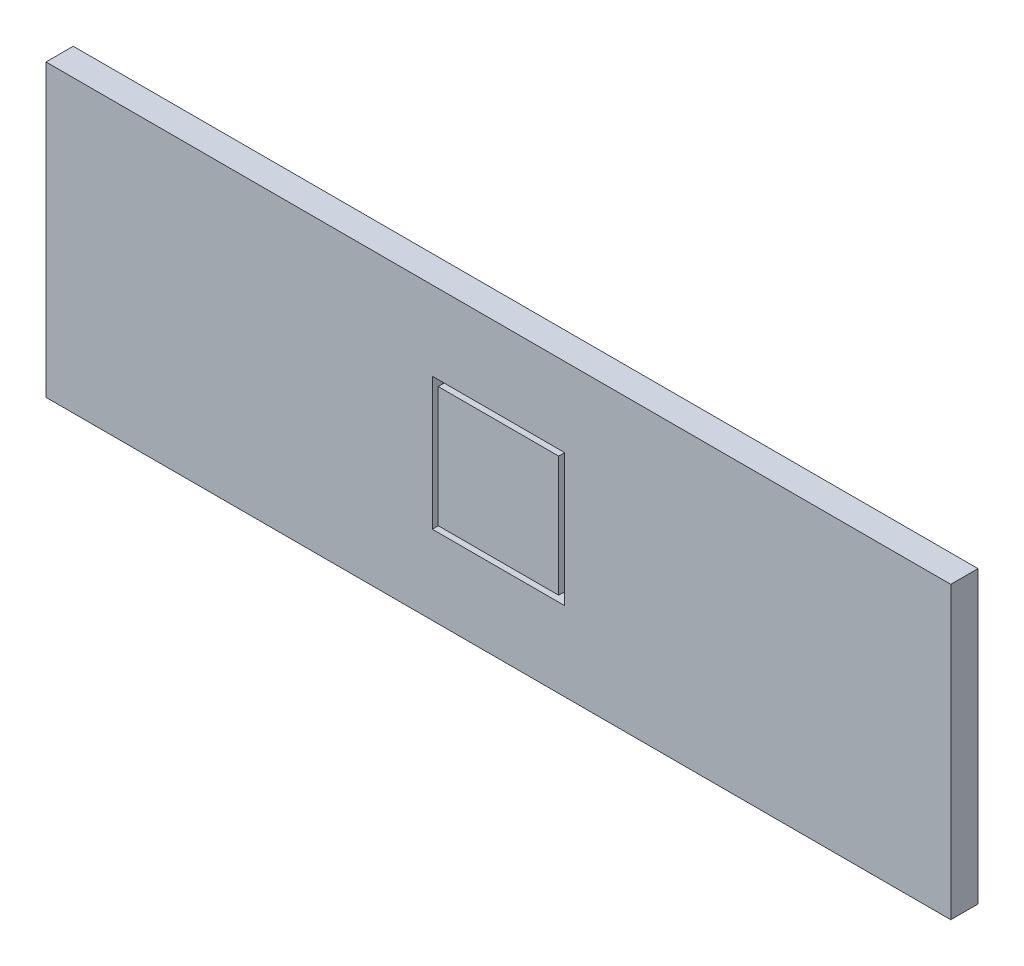
ISO-10303-21;
HEADER;
FILE_DESCRIPTION(('STEP AP214'),'2;1');
FILE_NAME('part.step','',(''),(''),'','','');
FILE_SCHEMA(('AUTOMOTIVE_DESIGN { 1 0 10303 214 1 1 1 1 }'));
ENDSEC;
DATA;
#1=APPLICATION_CONTEXT('core data for automotive mechanical design processes');
#2=APPLICATION_PROTOCOL_DEFINITION('international standard','automotive_design',2000,#1);
#3=PRODUCT_CONTEXT('',#1,'mechanical');
#4=PRODUCT('Part','Part','',(#3));
#5=PRODUCT_RELATED_PRODUCT_CATEGORY('part','',(#4));
#6=PRODUCT_DEFINITION_FORMATION('','',#4);
#7=PRODUCT_DEFINITION_CONTEXT('part definition',#1,'design');
#8=PRODUCT_DEFINITION('design','',#6,#7);
#9=PRODUCT_DEFINITION_SHAPE('','',#8);
#10=(LENGTH_UNIT() NAMED_UNIT(*) SI_UNIT(.MILLI.,.METRE.));
#11=(NAMED_UNIT(*) PLANE_ANGLE_UNIT() SI_UNIT($,.RADIAN.));
#12=(NAMED_UNIT(*) SI_UNIT($,.STERADIAN.) SOLID_ANGLE_UNIT());
#13=UNCERTAINTY_MEASURE_WITH_UNIT(LENGTH_MEASURE(1.E-05),#10,'distance_accuracy_value','');
#14=(GEOMETRIC_REPRESENTATION_CONTEXT(3) GLOBAL_UNCERTAINTY_ASSIGNED_CONTEXT((#13)) GLOBAL_UNIT_ASSIGNED_CONTEXT((#10,
#11,#12)) REPRESENTATION_CONTEXT('',''));
#15=CARTESIAN_POINT('',(0.,0.,0.));
#16=DIRECTION('',(0.,0.,1.));
#17=DIRECTION('',(1.,0.,0.));
#18=AXIS2_PLACEMENT_3D('',#15,#16,#17);
#19=CARTESIAN_POINT('',(-299.,-96.,18.));
#20=DIRECTION('',(1.,0.,0.));
#21=DIRECTION('',(0.,0.,-1.));
#22=AXIS2_PLACEMENT_3D('',#19,#20,#21);
#23=PLANE('',#22);
#24=DIRECTION('',(0.,-1.,0.));
#25=VECTOR('',#24,1.);
#26=CARTESIAN_POINT('',(-299.,-96.,0.));
#27=LINE('',#26,#25);
#28=CARTESIAN_POINT('',(-299.,96.,0.));
#29=VERTEX_POINT('',#28);
#30=CARTESIAN_POINT('',(-299.,-96.,0.));
#31=VERTEX_POINT('',#30);
#32=EDGE_CURVE('E451',#29,#31,#27,.T.);
#33=ORIENTED_EDGE('',*,*,#32,.T.);
#34=DIRECTION('',(0.,0.,-1.));
#35=VECTOR('',#34,1.);
#36=CARTESIAN_POINT('',(-299.,-96.,18.));
#37=LINE('',#36,#35);
#38=CARTESIAN_POINT('',(-299.,-96.,18.));
#39=VERTEX_POINT('',#38);
#40=EDGE_CURVE('E11',#39,#31,#37,.T.);
#41=ORIENTED_EDGE('',*,*,#40,.F.);
#42=DIRECTION('',(0.,-1.,0.));
#43=VECTOR('',#42,1.);
#44=CARTESIAN_POINT('',(-299.,-96.,18.));
#45=LINE('',#44,#43);
#46=CARTESIAN_POINT('',(-299.,96.,18.));
#47=VERTEX_POINT('',#46);
#48=EDGE_CURVE('E460',#47,#39,#45,.T.);
#49=ORIENTED_EDGE('',*,*,#48,.F.);
#50=DIRECTION('',(0.,0.,-1.));
#51=VECTOR('',#50,1.);
#52=CARTESIAN_POINT('',(-299.,96.,18.));
#53=LINE('',#52,#51);
#54=EDGE_CURVE('E470',#47,#29,#53,.T.);
#55=ORIENTED_EDGE('',*,*,#54,.T.);
#56=EDGE_LOOP('',(#33,#41,#49,#55));
#57=FACE_BOUND('',#56,.T.);
#58=ADVANCED_FACE('F38',(#57),#23,.F.);
#59=CARTESIAN_POINT('',(299.,-96.,18.));
#60=DIRECTION('',(0.,1.,0.));
#61=DIRECTION('',(-1.,0.,0.));
#62=AXIS2_PLACEMENT_3D('',#59,#60,#61);
#63=PLANE('',#62);
#64=DIRECTION('',(1.,0.,0.));
#65=VECTOR('',#64,1.);
#66=CARTESIAN_POINT('',(299.,-96.,0.));
#67=LINE('',#66,#65);
#68=CARTESIAN_POINT('',(299.,-96.,0.));
#69=VERTEX_POINT('',#68);
#70=EDGE_CURVE('E473',#31,#69,#67,.T.);
#71=ORIENTED_EDGE('',*,*,#70,.T.);
#72=DIRECTION('',(0.,0.,-1.));
#73=VECTOR('',#72,1.);
#74=CARTESIAN_POINT('',(299.,-96.,18.));
#75=LINE('',#74,#73);
#76=CARTESIAN_POINT('',(299.,-96.,18.));
#77=VERTEX_POINT('',#76);
#78=EDGE_CURVE('E45',#77,#69,#75,.T.);
#79=ORIENTED_EDGE('',*,*,#78,.F.);
#80=DIRECTION('',(1.,0.,0.));
#81=VECTOR('',#80,1.);
#82=CARTESIAN_POINT('',(299.,-96.,18.));
#83=LINE('',#82,#81);
#84=EDGE_CURVE('E463',#39,#77,#83,.T.);
#85=ORIENTED_EDGE('',*,*,#84,.F.);
#86=ORIENTED_EDGE('',*,*,#40,.T.);
#87=EDGE_LOOP('',(#71,#79,#85,#86));
#88=FACE_BOUND('',#87,.T.);
#89=ADVANCED_FACE('F503',(#88),#63,.F.);
#90=CARTESIAN_POINT('',(299.,-96.,18.));
#91=DIRECTION('',(-1.,0.,0.));
#92=DIRECTION('',(0.,0.,1.));
#93=AXIS2_PLACEMENT_3D('',#90,#91,#92);
#94=PLANE('',#93);
#95=DIRECTION('',(0.,1.,0.));
#96=VECTOR('',#95,1.);
#97=CARTESIAN_POINT('',(299.,-96.,0.));
#98=LINE('',#97,#96);
#99=CARTESIAN_POINT('',(299.,96.,0.));
#100=VERTEX_POINT('',#99);
#101=EDGE_CURVE('E475',#69,#100,#98,.T.);
#102=ORIENTED_EDGE('',*,*,#101,.T.);
#103=DIRECTION('',(0.,0.,-1.));
#104=VECTOR('',#103,1.);
#105=CARTESIAN_POINT('',(299.,96.,18.));
#106=LINE('',#105,#104);
#107=CARTESIAN_POINT('',(299.,96.,18.));
#108=VERTEX_POINT('',#107);
#109=EDGE_CURVE('E480',#108,#100,#106,.T.);
#110=ORIENTED_EDGE('',*,*,#109,.F.);
#111=DIRECTION('',(0.,1.,0.));
#112=VECTOR('',#111,1.);
#113=CARTESIAN_POINT('',(299.,-96.,18.));
#114=LINE('',#113,#112);
#115=EDGE_CURVE('E466',#77,#108,#114,.T.);
#116=ORIENTED_EDGE('',*,*,#115,.F.);
#117=ORIENTED_EDGE('',*,*,#78,.T.);
#118=EDGE_LOOP('',(#102,#110,#116,#117));
#119=FACE_BOUND('',#118,.T.);
#120=ADVANCED_FACE('F487',(#119),#94,.F.);
#121=CARTESIAN_POINT('',(299.,96.,18.));
#122=DIRECTION('',(0.,-1.,0.));
#123=DIRECTION('',(1.,0.,0.));
#124=AXIS2_PLACEMENT_3D('',#121,#122,#123);
#125=PLANE('',#124);
#126=DIRECTION('',(-1.,0.,0.));
#127=VECTOR('',#126,1.);
#128=CARTESIAN_POINT('',(299.,96.,0.));
#129=LINE('',#128,#127);
#130=EDGE_CURVE('E464',#100,#29,#129,.T.);
#131=ORIENTED_EDGE('',*,*,#130,.T.);
#132=ORIENTED_EDGE('',*,*,#54,.F.);
#133=DIRECTION('',(-1.,0.,0.));
#134=VECTOR('',#133,1.);
#135=CARTESIAN_POINT('',(299.,96.,18.));
#136=LINE('',#135,#134);
#137=EDGE_CURVE('E468',#108,#47,#136,.T.);
#138=ORIENTED_EDGE('',*,*,#137,.F.);
#139=ORIENTED_EDGE('',*,*,#109,.T.);
#140=EDGE_LOOP('',(#131,#132,#138,#139));
#141=FACE_BOUND('',#140,.T.);
#142=ADVANCED_FACE('F496',(#141),#125,.F.);
#143=CARTESIAN_POINT('',(0.,0.,18.));
#144=DIRECTION('',(0.,0.,1.));
#145=DIRECTION('',(1.,0.,0.));
#146=AXIS2_PLACEMENT_3D('',#143,#144,#145);
#147=PLANE('',#146);
#148=DIRECTION('',(0.,-1.,0.));
#149=VECTOR('',#148,1.);
#150=CARTESIAN_POINT('',(-43.7,-43.8,18.));
#151=LINE('',#150,#149);
#152=CARTESIAN_POINT('',(-43.7,43.8,18.));
#153=VERTEX_POINT('',#152);
#154=CARTESIAN_POINT('',(-43.7,-43.8,18.));
#155=VERTEX_POINT('',#154);
#156=EDGE_CURVE('E56',#153,#155,#151,.T.);
#157=ORIENTED_EDGE('',*,*,#156,.F.);
#158=DIRECTION('',(-1.,0.,0.));
#159=VECTOR('',#158,1.);
#160=CARTESIAN_POINT('',(43.7,43.8,18.));
#161=LINE('',#160,#159);
#162=CARTESIAN_POINT('',(43.7,43.8,18.));
#163=VERTEX_POINT('',#162);
#164=EDGE_CURVE('E427',#163,#153,#161,.T.);
#165=ORIENTED_EDGE('',*,*,#164,.F.);
#166=DIRECTION('',(0.,1.,0.));
#167=VECTOR('',#166,1.);
#168=CARTESIAN_POINT('',(43.7,-43.8,18.));
#169=LINE('',#168,#167);
#170=CARTESIAN_POINT('',(43.7,-43.8,18.));
#171=VERTEX_POINT('',#170);
#172=EDGE_CURVE('E444',#171,#163,#169,.T.);
#173=ORIENTED_EDGE('',*,*,#172,.F.);
#174=DIRECTION('',(1.,0.,0.));
#175=VECTOR('',#174,1.);
#176=CARTESIAN_POINT('',(43.7,-43.8,18.));
#177=LINE('',#176,#175);
#178=EDGE_CURVE('E441',#155,#171,#177,.T.);
#179=ORIENTED_EDGE('',*,*,#178,.F.);
#180=EDGE_LOOP('',(#157,#165,#173,#179));
#181=FACE_BOUND('',#180,.T.);
#182=ORIENTED_EDGE('',*,*,#48,.T.);
#183=ORIENTED_EDGE('',*,*,#84,.T.);
#184=ORIENTED_EDGE('',*,*,#115,.T.);
#185=ORIENTED_EDGE('',*,*,#137,.T.);
#186=EDGE_LOOP('',(#182,#183,#184,#185));
#187=FACE_BOUND('',#186,.T.);
#188=ADVANCED_FACE('F502',(#181,#187),#147,.T.);
#189=CARTESIAN_POINT('',(0.,0.,0.));
#190=DIRECTION('',(0.,0.,1.));
#191=DIRECTION('',(1.,0.,0.));
#192=AXIS2_PLACEMENT_3D('',#189,#190,#191);
#193=PLANE('',#192);
#194=ORIENTED_EDGE('',*,*,#32,.F.);
#195=ORIENTED_EDGE('',*,*,#130,.F.);
#196=ORIENTED_EDGE('',*,*,#101,.F.);
#197=ORIENTED_EDGE('',*,*,#70,.F.);
#198=EDGE_LOOP('',(#194,#195,#196,#197));
#199=FACE_BOUND('',#198,.T.);
#200=ADVANCED_FACE('F493',(#199),#193,.F.);
#201=CARTESIAN_POINT('',(-43.7,-43.8,11.));
#202=DIRECTION('',(-1.,0.,0.));
#203=DIRECTION('',(0.,0.,1.));
#204=AXIS2_PLACEMENT_3D('',#201,#202,#203);
#205=PLANE('',#204);
#206=ORIENTED_EDGE('',*,*,#156,.T.);
#207=DIRECTION('',(0.,0.,1.));
#208=VECTOR('',#207,1.);
#209=CARTESIAN_POINT('',(-43.7,-43.8,11.));
#210=LINE('',#209,#208);
#211=CARTESIAN_POINT('',(-43.7,-43.8,11.));
#212=VERTEX_POINT('',#211);
#213=EDGE_CURVE('E439',#212,#155,#210,.T.);
#214=ORIENTED_EDGE('',*,*,#213,.F.);
#215=DIRECTION('',(0.,-1.,0.));
#216=VECTOR('',#215,1.);
#217=CARTESIAN_POINT('',(-43.7,-43.8,11.));
#218=LINE('',#217,#216);
#219=CARTESIAN_POINT('',(-43.7,43.8,11.));
#220=VERTEX_POINT('',#219);
#221=EDGE_CURVE('E423',#220,#212,#218,.T.);
#222=ORIENTED_EDGE('',*,*,#221,.F.);
#223=DIRECTION('',(0.,0.,1.));
#224=VECTOR('',#223,1.);
#225=CARTESIAN_POINT('',(-43.7,43.8,11.));
#226=LINE('',#225,#224);
#227=EDGE_CURVE('E449',#220,#153,#226,.T.);
#228=ORIENTED_EDGE('',*,*,#227,.T.);
#229=EDGE_LOOP('',(#206,#214,#222,#228));
#230=FACE_BOUND('',#229,.T.);
#231=ADVANCED_FACE('F515',(#230),#205,.F.);
#232=CARTESIAN_POINT('',(43.7,43.8,11.));
#233=DIRECTION('',(0.,1.,0.));
#234=DIRECTION('',(-1.,0.,0.));
#235=AXIS2_PLACEMENT_3D('',#232,#233,#234);
#236=PLANE('',#235);
#237=ORIENTED_EDGE('',*,*,#164,.T.);
#238=ORIENTED_EDGE('',*,*,#227,.F.);
#239=DIRECTION('',(-1.,0.,0.));
#240=VECTOR('',#239,1.);
#241=CARTESIAN_POINT('',(43.7,43.8,11.));
#242=LINE('',#241,#240);
#243=CARTESIAN_POINT('',(43.7,43.8,11.));
#244=VERTEX_POINT('',#243);
#245=EDGE_CURVE('E435',#244,#220,#242,.T.);
#246=ORIENTED_EDGE('',*,*,#245,.F.);
#247=DIRECTION('',(0.,0.,1.));
#248=VECTOR('',#247,1.);
#249=CARTESIAN_POINT('',(43.7,43.8,11.));
#250=LINE('',#249,#248);
#251=EDGE_CURVE('E452',#244,#163,#250,.T.);
#252=ORIENTED_EDGE('',*,*,#251,.T.);
#253=EDGE_LOOP('',(#237,#238,#246,#252));
#254=FACE_BOUND('',#253,.T.);
#255=ADVANCED_FACE('F522',(#254),#236,.F.);
#256=CARTESIAN_POINT('',(43.7,-43.8,11.));
#257=DIRECTION('',(1.,0.,0.));
#258=DIRECTION('',(0.,0.,-1.));
#259=AXIS2_PLACEMENT_3D('',#256,#257,#258);
#260=PLANE('',#259);
#261=ORIENTED_EDGE('',*,*,#172,.T.);
#262=ORIENTED_EDGE('',*,*,#251,.F.);
#263=DIRECTION('',(0.,1.,0.));
#264=VECTOR('',#263,1.);
#265=CARTESIAN_POINT('',(43.7,-43.8,11.));
#266=LINE('',#265,#264);
#267=CARTESIAN_POINT('',(43.7,-43.8,11.));
#268=VERTEX_POINT('',#267);
#269=EDGE_CURVE('E431',#268,#244,#266,.T.);
#270=ORIENTED_EDGE('',*,*,#269,.F.);
#271=DIRECTION('',(0.,0.,1.));
#272=VECTOR('',#271,1.);
#273=CARTESIAN_POINT('',(43.7,-43.8,11.));
#274=LINE('',#273,#272);
#275=EDGE_CURVE('E455',#268,#171,#274,.T.);
#276=ORIENTED_EDGE('',*,*,#275,.T.);
#277=EDGE_LOOP('',(#261,#262,#270,#276));
#278=FACE_BOUND('',#277,.T.);
#279=ADVANCED_FACE('F527',(#278),#260,.F.);
#280=CARTESIAN_POINT('',(43.7,-43.8,11.));
#281=DIRECTION('',(0.,-1.,0.));
#282=DIRECTION('',(1.,0.,0.));
#283=AXIS2_PLACEMENT_3D('',#280,#281,#282);
#284=PLANE('',#283);
#285=ORIENTED_EDGE('',*,*,#178,.T.);
#286=ORIENTED_EDGE('',*,*,#275,.F.);
#287=DIRECTION('',(1.,0.,0.));
#288=VECTOR('',#287,1.);
#289=CARTESIAN_POINT('',(43.7,-43.8,11.));
#290=LINE('',#289,#288);
#291=EDGE_CURVE('E426',#212,#268,#290,.T.);
#292=ORIENTED_EDGE('',*,*,#291,.F.);
#293=ORIENTED_EDGE('',*,*,#213,.T.);
#294=EDGE_LOOP('',(#285,#286,#292,#293));
#295=FACE_BOUND('',#294,.T.);
#296=ADVANCED_FACE('F523',(#295),#284,.F.);
#297=CARTESIAN_POINT('',(0.,0.,11.));
#298=DIRECTION('',(0.,0.,1.));
#299=DIRECTION('',(1.,0.,0.));
#300=AXIS2_PLACEMENT_3D('',#297,#298,#299);
#301=PLANE('',#300);
#302=DIRECTION('',(-1.,0.,0.));
#303=VECTOR('',#302,1.);
#304=CARTESIAN_POINT('',(39.8232129920401,39.8232129920402,11.));
#305=LINE('',#304,#303);
#306=CARTESIAN_POINT('',(39.8232129920401,39.8232129920402,11.));
#307=VERTEX_POINT('',#306);
#308=CARTESIAN_POINT('',(-39.8232129920402,39.8232129920402,11.));
#309=VERTEX_POINT('',#308);
#310=EDGE_CURVE('E403',#307,#309,#305,.T.);
#311=ORIENTED_EDGE('',*,*,#310,.F.);
#312=DIRECTION('',(0.,1.,0.));
#313=VECTOR('',#312,1.);
#314=CARTESIAN_POINT('',(39.8232129920401,-39.8232129920402,11.));
#315=LINE('',#314,#313);
#316=CARTESIAN_POINT('',(39.8232129920401,-39.8232129920402,11.));
#317=VERTEX_POINT('',#316);
#318=EDGE_CURVE('E399',#317,#307,#315,.T.);
#319=ORIENTED_EDGE('',*,*,#318,.F.);
#320=DIRECTION('',(1.,0.,0.));
#321=VECTOR('',#320,1.);
#322=CARTESIAN_POINT('',(39.8232129920401,-39.8232129920402,11.));
#323=LINE('',#322,#321);
#324=CARTESIAN_POINT('',(-39.8232129920402,-39.8232129920402,11.));
#325=VERTEX_POINT('',#324);
#326=EDGE_CURVE('E394',#325,#317,#323,.T.);
#327=ORIENTED_EDGE('',*,*,#326,.F.);
#328=DIRECTION('',(0.,-1.,0.));
#329=VECTOR('',#328,1.);
#330=CARTESIAN_POINT('',(-39.8232129920402,-39.8232129920402,11.));
#331=LINE('',#330,#329);
#332=EDGE_CURVE('E390',#309,#325,#331,.T.);
#333=ORIENTED_EDGE('',*,*,#332,.F.);
#334=EDGE_LOOP('',(#311,#319,#327,#333));
#335=FACE_BOUND('',#334,.T.);
#336=ORIENTED_EDGE('',*,*,#221,.T.);
#337=ORIENTED_EDGE('',*,*,#291,.T.);
#338=ORIENTED_EDGE('',*,*,#269,.T.);
#339=ORIENTED_EDGE('',*,*,#245,.T.);
#340=EDGE_LOOP('',(#336,#337,#338,#339));
#341=FACE_BOUND('',#340,.T.);
#342=ADVANCED_FACE('F526',(#335,#341),#301,.T.);
#343=CARTESIAN_POINT('',(-39.8232129920402,-39.8232129920402,11.));
#344=DIRECTION('',(-1.,0.,0.));
#345=DIRECTION('',(0.,0.,1.));
#346=AXIS2_PLACEMENT_3D('',#343,#344,#345);
#347=PLANE('',#346);
#348=DIRECTION('',(0.,-1.,0.));
#349=VECTOR('',#348,1.);
#350=CARTESIAN_POINT('',(-39.8232129920402,-39.8232129920402,18.));
#351=LINE('',#350,#349);
#352=CARTESIAN_POINT('',(-39.8232129920402,39.8232129920402,18.));
#353=VERTEX_POINT('',#352);
#354=CARTESIAN_POINT('',(-39.8232129920402,-39.8232129920402,18.));
#355=VERTEX_POINT('',#354);
#356=EDGE_CURVE('E374',#353,#355,#351,.T.);
#357=ORIENTED_EDGE('',*,*,#356,.F.);
#358=DIRECTION('',(0.,0.,1.));
#359=VECTOR('',#358,1.);
#360=CARTESIAN_POINT('',(-39.8232129920402,39.8232129920402,11.));
#361=LINE('',#360,#359);
#362=EDGE_CURVE('E416',#309,#353,#361,.T.);
#363=ORIENTED_EDGE('',*,*,#362,.F.);
#364=ORIENTED_EDGE('',*,*,#332,.T.);
#365=DIRECTION('',(0.,0.,1.));
#366=VECTOR('',#365,1.);
#367=CARTESIAN_POINT('',(-39.8232129920402,-39.8232129920402,11.));
#368=LINE('',#367,#366);
#369=EDGE_CURVE('E407',#325,#355,#368,.T.);
#370=ORIENTED_EDGE('',*,*,#369,.T.);
#371=EDGE_LOOP('',(#357,#363,#364,#370));
#372=FACE_BOUND('',#371,.T.);
#373=ADVANCED_FACE('F537',(#372),#347,.T.);
#374=CARTESIAN_POINT('',(39.8232129920401,39.8232129920402,11.));
#375=DIRECTION('',(0.,1.,0.));
#376=DIRECTION('',(0.,0.,1.));
#377=AXIS2_PLACEMENT_3D('',#374,#375,#376);
#378=PLANE('',#377);
#379=DIRECTION('',(-1.,0.,0.));
#380=VECTOR('',#379,1.);
#381=CARTESIAN_POINT('',(39.8232129920401,39.8232129920402,18.));
#382=LINE('',#381,#380);
#383=CARTESIAN_POINT('',(39.8232129920401,39.8232129920402,18.));
#384=VERTEX_POINT('',#383);
#385=EDGE_CURVE('E395',#384,#353,#382,.T.);
#386=ORIENTED_EDGE('',*,*,#385,.F.);
#387=DIRECTION('',(0.,0.,1.));
#388=VECTOR('',#387,1.);
#389=CARTESIAN_POINT('',(39.8232129920401,39.8232129920402,11.));
#390=LINE('',#389,#388);
#391=EDGE_CURVE('E418',#307,#384,#390,.T.);
#392=ORIENTED_EDGE('',*,*,#391,.F.);
#393=ORIENTED_EDGE('',*,*,#310,.T.);
#394=ORIENTED_EDGE('',*,*,#362,.T.);
#395=EDGE_LOOP('',(#386,#392,#393,#394));
#396=FACE_BOUND('',#395,.T.);
#397=ADVANCED_FACE('F541',(#396),#378,.T.);
#398=CARTESIAN_POINT('',(39.8232129920401,-39.8232129920402,11.));
#399=DIRECTION('',(1.,0.,0.));
#400=DIRECTION('',(0.,0.,-1.));
#401=AXIS2_PLACEMENT_3D('',#398,#399,#400);
#402=PLANE('',#401);
#403=DIRECTION('',(0.,1.,0.));
#404=VECTOR('',#403,1.);
#405=CARTESIAN_POINT('',(39.8232129920401,-39.8232129920402,18.));
#406=LINE('',#405,#404);
#407=CARTESIAN_POINT('',(39.8232129920401,-39.8232129920402,18.));
#408=VERTEX_POINT('',#407);
#409=EDGE_CURVE('E64',#408,#384,#406,.T.);
#410=ORIENTED_EDGE('',*,*,#409,.F.);
#411=DIRECTION('',(0.,0.,1.));
#412=VECTOR('',#411,1.);
#413=CARTESIAN_POINT('',(39.8232129920401,-39.8232129920402,11.));
#414=LINE('',#413,#412);
#415=EDGE_CURVE('E420',#317,#408,#414,.T.);
#416=ORIENTED_EDGE('',*,*,#415,.F.);
#417=ORIENTED_EDGE('',*,*,#318,.T.);
#418=ORIENTED_EDGE('',*,*,#391,.T.);
#419=EDGE_LOOP('',(#410,#416,#417,#418));
#420=FACE_BOUND('',#419,.T.);
#421=ADVANCED_FACE('F546',(#420),#402,.T.);
#422=CARTESIAN_POINT('',(39.8232129920401,-39.8232129920402,11.));
#423=DIRECTION('',(0.,-1.,0.));
#424=DIRECTION('',(0.,0.,-1.));
#425=AXIS2_PLACEMENT_3D('',#422,#423,#424);
#426=PLANE('',#425);
#427=DIRECTION('',(1.,0.,0.));
#428=VECTOR('',#427,1.);
#429=CARTESIAN_POINT('',(39.8232129920401,-39.8232129920402,18.));
#430=LINE('',#429,#428);
#431=EDGE_CURVE('E410',#355,#408,#430,.T.);
#432=ORIENTED_EDGE('',*,*,#431,.F.);
#433=ORIENTED_EDGE('',*,*,#369,.F.);
#434=ORIENTED_EDGE('',*,*,#326,.T.);
#435=ORIENTED_EDGE('',*,*,#415,.T.);
#436=EDGE_LOOP('',(#432,#433,#434,#435));
#437=FACE_BOUND('',#436,.T.);
#438=ADVANCED_FACE('F543',(#437),#426,.T.);
#439=ORIENTED_EDGE('',*,*,#385,.T.);
#440=ORIENTED_EDGE('',*,*,#356,.T.);
#441=ORIENTED_EDGE('',*,*,#431,.T.);
#442=ORIENTED_EDGE('',*,*,#409,.T.);
#443=EDGE_LOOP('',(#439,#440,#441,#442));
#444=FACE_BOUND('',#443,.T.);
#445=ADVANCED_FACE('F519',(#444),#147,.T.);
#446=CLOSED_SHELL('',(#58,#89,#120,#142,#188,#200,#231,#255,#279,#296,#342,#373,#397,#421,#438,#445));
#447=CARTESIAN_POINT('',(-30.,4.89899989998001,0.499999999999999));
#448=DIRECTION('',(-1.,0.,0.));
#449=DIRECTION('',(0.,-1.,0.));
#450=AXIS2_PLACEMENT_3D('',#447,#448,#449);
#451=PLANE('',#450);
#452=DIRECTION('',(0.,-1.,0.));
#453=VECTOR('',#452,1.);
#454=CARTESIAN_POINT('',(-30.,4.89899989998001,11.));
#455=LINE('',#454,#453);
#456=CARTESIAN_POINT('',(-30.,33.8,11.));
#457=VERTEX_POINT('',#456);
#458=CARTESIAN_POINT('',(-30.,4.89899989998001,11.));
#459=VERTEX_POINT('',#458);
#460=EDGE_CURVE('E303',#457,#459,#455,.T.);
#461=ORIENTED_EDGE('',*,*,#460,.T.);
#462=DIRECTION('',(0.,0.,1.));
#463=VECTOR('',#462,1.);
#464=CARTESIAN_POINT('',(-30.,4.89899989998001,0.499999999999999));
#465=LINE('',#464,#463);
#466=CARTESIAN_POINT('',(-30.,4.89899989998001,0.499999999999999));
#467=VERTEX_POINT('',#466);
#468=EDGE_CURVE('E347',#467,#459,#465,.T.);
#469=ORIENTED_EDGE('',*,*,#468,.F.);
#470=DIRECTION('',(0.,-1.,0.));
#471=VECTOR('',#470,1.);
#472=CARTESIAN_POINT('',(-30.,4.89899989998001,0.499999999999999));
#473=LINE('',#472,#471);
#474=CARTESIAN_POINT('',(-30.,33.8,0.499999999999999));
#475=VERTEX_POINT('',#474);
#476=EDGE_CURVE('E315',#475,#467,#473,.T.);
#477=ORIENTED_EDGE('',*,*,#476,.F.);
#478=DIRECTION('',(0.,0.,1.));
#479=VECTOR('',#478,1.);
#480=CARTESIAN_POINT('',(-30.,33.8,0.499999999999999));
#481=LINE('',#480,#479);
#482=EDGE_CURVE('E372',#475,#457,#481,.T.);
#483=ORIENTED_EDGE('',*,*,#482,.T.);
#484=EDGE_LOOP('',(#461,#469,#477,#483));
#485=FACE_BOUND('',#484,.T.);
#486=ADVANCED_FACE('F553',(#485),#451,.F.);
#487=CARTESIAN_POINT('',(30.,33.8,0.499999999999999));
#488=DIRECTION('',(0.,1.,0.));
#489=DIRECTION('',(0.,0.,1.));
#490=AXIS2_PLACEMENT_3D('',#487,#488,#489);
#491=PLANE('',#490);
#492=DIRECTION('',(-1.,0.,0.));
#493=VECTOR('',#492,1.);
#494=CARTESIAN_POINT('',(30.,33.8,11.));
#495=LINE('',#494,#493);
#496=CARTESIAN_POINT('',(30.,33.8,11.));
#497=VERTEX_POINT('',#496);
#498=EDGE_CURVE('E319',#497,#457,#495,.T.);
#499=ORIENTED_EDGE('',*,*,#498,.T.);
#500=ORIENTED_EDGE('',*,*,#482,.F.);
#501=DIRECTION('',(-1.,0.,0.));
#502=VECTOR('',#501,1.);
#503=CARTESIAN_POINT('',(30.,33.8,0.499999999999999));
#504=LINE('',#503,#502);
#505=CARTESIAN_POINT('',(30.,33.8,0.499999999999999));
#506=VERTEX_POINT('',#505);
#507=EDGE_CURVE('E343',#506,#475,#504,.T.);
#508=ORIENTED_EDGE('',*,*,#507,.F.);
#509=DIRECTION('',(0.,0.,1.));
#510=VECTOR('',#509,1.);
#511=CARTESIAN_POINT('',(30.,33.8,0.499999999999999));
#512=LINE('',#511,#510);
#513=EDGE_CURVE('E375',#506,#497,#512,.T.);
#514=ORIENTED_EDGE('',*,*,#513,.T.);
#515=EDGE_LOOP('',(#499,#500,#508,#514));
#516=FACE_BOUND('',#515,.T.);
#517=ADVANCED_FACE('F556',(#516),#491,.F.);
#518=CARTESIAN_POINT('',(30.,4.89899989998001,0.499999999999999));
#519=DIRECTION('',(1.,0.,0.));
#520=DIRECTION('',(0.,1.,0.));
#521=AXIS2_PLACEMENT_3D('',#518,#519,#520);
#522=PLANE('',#521);
#523=DIRECTION('',(0.,1.,0.));
#524=VECTOR('',#523,1.);
#525=CARTESIAN_POINT('',(30.,4.89899989998001,11.));
#526=LINE('',#525,#524);
#527=CARTESIAN_POINT('',(30.,4.89899989998001,11.));
#528=VERTEX_POINT('',#527);
#529=EDGE_CURVE('E367',#528,#497,#526,.T.);
#530=ORIENTED_EDGE('',*,*,#529,.T.);
#531=ORIENTED_EDGE('',*,*,#513,.F.);
#532=DIRECTION('',(0.,1.,0.));
#533=VECTOR('',#532,1.);
#534=CARTESIAN_POINT('',(30.,4.89899989998001,0.499999999999999));
#535=LINE('',#534,#533);
#536=CARTESIAN_POINT('',(30.,4.89899989998001,0.499999999999999));
#537=VERTEX_POINT('',#536);
#538=EDGE_CURVE('E339',#537,#506,#535,.T.);
#539=ORIENTED_EDGE('',*,*,#538,.F.);
#540=DIRECTION('',(0.,0.,1.));
#541=VECTOR('',#540,1.);
#542=CARTESIAN_POINT('',(30.,4.89899989998001,0.499999999999999));
#543=LINE('',#542,#541);
#544=EDGE_CURVE('E377',#537,#528,#543,.T.);
#545=ORIENTED_EDGE('',*,*,#544,.T.);
#546=EDGE_LOOP('',(#530,#531,#539,#545));
#547=FACE_BOUND('',#546,.T.);
#548=ADVANCED_FACE('F578',(#547),#522,.F.);
#549=CARTESIAN_POINT('',(30.2,-0.099999999999982,0.499999999999999));
#550=DIRECTION('',(0.,0.,1.));
#551=DIRECTION('',(1.,0.,0.));
#552=AXIS2_PLACEMENT_3D('',#549,#550,#551);
#553=CYLINDRICAL_SURFACE('',#552,5.00299910053959);
#554=CARTESIAN_POINT('',(30.2,-0.099999999999982,11.));
#555=DIRECTION('',(0.,0.,-1.));
#556=DIRECTION('',(1.,0.,0.));
#557=AXIS2_PLACEMENT_3D('',#554,#555,#556);
#558=CIRCLE('',#557,5.00299910053959);
#559=CARTESIAN_POINT('',(30.,-5.09899989997997,11.));
#560=VERTEX_POINT('',#559);
#561=EDGE_CURVE('E364',#560,#528,#558,.T.);
#562=ORIENTED_EDGE('',*,*,#561,.T.);
#563=ORIENTED_EDGE('',*,*,#544,.F.);
#564=CARTESIAN_POINT('',(30.2,-0.099999999999982,0.499999999999999));
#565=DIRECTION('',(0.,0.,-1.));
#566=DIRECTION('',(1.,0.,0.));
#567=AXIS2_PLACEMENT_3D('',#564,#565,#566);
#568=CIRCLE('',#567,5.00299910053959);
#569=CARTESIAN_POINT('',(30.,-5.09899989997997,0.499999999999999));
#570=VERTEX_POINT('',#569);
#571=EDGE_CURVE('E335',#570,#537,#568,.T.);
#572=ORIENTED_EDGE('',*,*,#571,.F.);
#573=DIRECTION('',(0.,0.,1.));
#574=VECTOR('',#573,1.);
#575=CARTESIAN_POINT('',(30.,-5.09899989997997,0.499999999999999));
#576=LINE('',#575,#574);
#577=EDGE_CURVE('E379',#570,#560,#576,.T.);
#578=ORIENTED_EDGE('',*,*,#577,.T.);
#579=EDGE_LOOP('',(#562,#563,#572,#578));
#580=FACE_BOUND('',#579,.T.);
#581=ADVANCED_FACE('F574',(#580),#553,.T.);
#582=CARTESIAN_POINT('',(30.,-33.2,0.499999999999999));
#583=DIRECTION('',(1.,0.,0.));
#584=DIRECTION('',(0.,1.,0.));
#585=AXIS2_PLACEMENT_3D('',#582,#583,#584);
#586=PLANE('',#585);
#587=DIRECTION('',(0.,1.,0.));
#588=VECTOR('',#587,1.);
#589=CARTESIAN_POINT('',(30.,-33.2,11.));
#590=LINE('',#589,#588);
#591=CARTESIAN_POINT('',(30.,-33.2,11.));
#592=VERTEX_POINT('',#591);
#593=EDGE_CURVE('E360',#592,#560,#590,.T.);
#594=ORIENTED_EDGE('',*,*,#593,.T.);
#595=ORIENTED_EDGE('',*,*,#577,.F.);
#596=DIRECTION('',(0.,1.,0.));
#597=VECTOR('',#596,1.);
#598=CARTESIAN_POINT('',(30.,-33.2,0.499999999999999));
#599=LINE('',#598,#597);
#600=CARTESIAN_POINT('',(30.,-33.2,0.499999999999999));
#601=VERTEX_POINT('',#600);
#602=EDGE_CURVE('E331',#601,#570,#599,.T.);
#603=ORIENTED_EDGE('',*,*,#602,.F.);
#604=DIRECTION('',(0.,0.,1.));
#605=VECTOR('',#604,1.);
#606=CARTESIAN_POINT('',(30.,-33.2,0.499999999999999));
#607=LINE('',#606,#605);
#608=EDGE_CURVE('E381',#601,#592,#607,.T.);
#609=ORIENTED_EDGE('',*,*,#608,.T.);
#610=EDGE_LOOP('',(#594,#595,#603,#609));
#611=FACE_BOUND('',#610,.T.);
#612=ADVANCED_FACE('F570',(#611),#586,.F.);
#613=CARTESIAN_POINT('',(30.,-33.2,0.499999999999999));
#614=DIRECTION('',(0.,-1.,0.));
#615=DIRECTION('',(0.,0.,-1.));
#616=AXIS2_PLACEMENT_3D('',#613,#614,#615);
#617=PLANE('',#616);
#618=DIRECTION('',(1.,0.,0.));
#619=VECTOR('',#618,1.);
#620=CARTESIAN_POINT('',(30.,-33.2,11.));
#621=LINE('',#620,#619);
#622=CARTESIAN_POINT('',(-30.,-33.2,11.));
#623=VERTEX_POINT('',#622);
#624=EDGE_CURVE('E357',#623,#592,#621,.T.);
#625=ORIENTED_EDGE('',*,*,#624,.T.);
#626=ORIENTED_EDGE('',*,*,#608,.F.);
#627=DIRECTION('',(1.,0.,0.));
#628=VECTOR('',#627,1.);
#629=CARTESIAN_POINT('',(30.,-33.2,0.499999999999999));
#630=LINE('',#629,#628);
#631=CARTESIAN_POINT('',(-30.,-33.2,0.499999999999999));
#632=VERTEX_POINT('',#631);
#633=EDGE_CURVE('E327',#632,#601,#630,.T.);
#634=ORIENTED_EDGE('',*,*,#633,.F.);
#635=DIRECTION('',(0.,0.,1.));
#636=VECTOR('',#635,1.);
#637=CARTESIAN_POINT('',(-30.,-33.2,0.499999999999999));
#638=LINE('',#637,#636);
#639=EDGE_CURVE('E384',#632,#623,#638,.T.);
#640=ORIENTED_EDGE('',*,*,#639,.T.);
#641=EDGE_LOOP('',(#625,#626,#634,#640));
#642=FACE_BOUND('',#641,.T.);
#643=ADVANCED_FACE('F566',(#642),#617,.F.);
#644=CARTESIAN_POINT('',(-30.,-33.2,0.499999999999999));
#645=DIRECTION('',(-1.,0.,0.));
#646=DIRECTION('',(0.,-1.,0.));
#647=AXIS2_PLACEMENT_3D('',#644,#645,#646);
#648=PLANE('',#647);
#649=DIRECTION('',(0.,-1.,0.));
#650=VECTOR('',#649,1.);
#651=CARTESIAN_POINT('',(-30.,-33.2,11.));
#652=LINE('',#651,#650);
#653=CARTESIAN_POINT('',(-30.,-5.09899989997997,11.));
#654=VERTEX_POINT('',#653);
#655=EDGE_CURVE('E353',#654,#623,#652,.T.);
#656=ORIENTED_EDGE('',*,*,#655,.T.);
#657=ORIENTED_EDGE('',*,*,#639,.F.);
#658=DIRECTION('',(0.,-1.,0.));
#659=VECTOR('',#658,1.);
#660=CARTESIAN_POINT('',(-30.,-33.2,0.499999999999999));
#661=LINE('',#660,#659);
#662=CARTESIAN_POINT('',(-30.,-5.09899989997997,0.499999999999999));
#663=VERTEX_POINT('',#662);
#664=EDGE_CURVE('E323',#663,#632,#661,.T.);
#665=ORIENTED_EDGE('',*,*,#664,.F.);
#666=DIRECTION('',(0.,0.,1.));
#667=VECTOR('',#666,1.);
#668=CARTESIAN_POINT('',(-30.,-5.09899989997997,0.499999999999999));
#669=LINE('',#668,#667);
#670=EDGE_CURVE('E387',#663,#654,#669,.T.);
#671=ORIENTED_EDGE('',*,*,#670,.T.);
#672=EDGE_LOOP('',(#656,#657,#665,#671));
#673=FACE_BOUND('',#672,.T.);
#674=ADVANCED_FACE('F562',(#673),#648,.F.);
#675=CARTESIAN_POINT('',(-30.2,-0.099999999999982,0.499999999999999));
#676=DIRECTION('',(0.,0.,1.));
#677=DIRECTION('',(1.,0.,0.));
#678=AXIS2_PLACEMENT_3D('',#675,#676,#677);
#679=CYLINDRICAL_SURFACE('',#678,5.00299910053959);
#680=CARTESIAN_POINT('',(-30.2,-0.099999999999982,11.));
#681=DIRECTION('',(0.,0.,-1.));
#682=DIRECTION('',(1.,0.,0.));
#683=AXIS2_PLACEMENT_3D('',#680,#681,#682);
#684=CIRCLE('',#683,5.00299910053959);
#685=EDGE_CURVE('E350',#459,#654,#684,.T.);
#686=ORIENTED_EDGE('',*,*,#685,.T.);
#687=ORIENTED_EDGE('',*,*,#670,.F.);
#688=CARTESIAN_POINT('',(-30.2,-0.099999999999982,0.499999999999999));
#689=DIRECTION('',(0.,0.,-1.));
#690=DIRECTION('',(1.,0.,0.));
#691=AXIS2_PLACEMENT_3D('',#688,#689,#690);
#692=CIRCLE('',#691,5.00299910053959);
#693=EDGE_CURVE('E318',#467,#663,#692,.T.);
#694=ORIENTED_EDGE('',*,*,#693,.F.);
#695=ORIENTED_EDGE('',*,*,#468,.T.);
#696=EDGE_LOOP('',(#686,#687,#694,#695));
#697=FACE_BOUND('',#696,.T.);
#698=ADVANCED_FACE('F559',(#697),#679,.T.);
#699=CARTESIAN_POINT('',(30.2,-0.099999999999982,0.499999999999999));
#700=DIRECTION('',(0.,0.,1.));
#701=DIRECTION('',(1.,0.,0.));
#702=AXIS2_PLACEMENT_3D('',#699,#700,#701);
#703=PLANE('',#702);
#704=DIRECTION('',(-1.,0.,0.));
#705=VECTOR('',#704,1.);
#706=CARTESIAN_POINT('',(26.16375102958,29.5161886496977,0.499999999999999));
#707=LINE('',#706,#705);
#708=CARTESIAN_POINT('',(26.16375102958,29.5161886496977,0.499999999999999));
#709=VERTEX_POINT('',#708);
#710=CARTESIAN_POINT('',(-26.16375102958,29.5161886496977,0.499999999999999));
#711=VERTEX_POINT('',#710);
#712=EDGE_CURVE('E239',#709,#711,#707,.T.);
#713=ORIENTED_EDGE('',*,*,#712,.F.);
#714=DIRECTION('',(0.,1.,0.));
#715=VECTOR('',#714,1.);
#716=CARTESIAN_POINT('',(26.16375102958,7.89336900227061,0.499999999999999));
#717=LINE('',#716,#715);
#718=CARTESIAN_POINT('',(26.16375102958,7.89336900227061,0.499999999999999));
#719=VERTEX_POINT('',#718);
#720=EDGE_CURVE('E280',#719,#709,#717,.T.);
#721=ORIENTED_EDGE('',*,*,#720,.F.);
#722=CARTESIAN_POINT('',(30.2,-0.099999999999982,0.499999999999999));
#723=DIRECTION('',(0.,0.,-1.));
#724=DIRECTION('',(1.,0.,0.));
#725=AXIS2_PLACEMENT_3D('',#722,#723,#724);
#726=CIRCLE('',#725,8.95462192153732);
#727=CARTESIAN_POINT('',(26.16375102958,-8.09336900227057,0.499999999999999));
#728=VERTEX_POINT('',#727);
#729=EDGE_CURVE('E276',#728,#719,#726,.T.);
#730=ORIENTED_EDGE('',*,*,#729,.F.);
#731=DIRECTION('',(0.,1.,0.));
#732=VECTOR('',#731,1.);
#733=CARTESIAN_POINT('',(26.16375102958,-28.9161886496977,0.499999999999999));
#734=LINE('',#733,#732);
#735=CARTESIAN_POINT('',(26.16375102958,-28.9161886496977,0.499999999999999));
#736=VERTEX_POINT('',#735);
#737=EDGE_CURVE('E272',#736,#728,#734,.T.);
#738=ORIENTED_EDGE('',*,*,#737,.F.);
#739=DIRECTION('',(1.,0.,0.));
#740=VECTOR('',#739,1.);
#741=CARTESIAN_POINT('',(26.16375102958,-28.9161886496977,0.499999999999999));
#742=LINE('',#741,#740);
#743=CARTESIAN_POINT('',(-26.16375102958,-28.9161886496977,0.499999999999999));
#744=VERTEX_POINT('',#743);
#745=EDGE_CURVE('E268',#744,#736,#742,.T.);
#746=ORIENTED_EDGE('',*,*,#745,.F.);
#747=DIRECTION('',(0.,-1.,0.));
#748=VECTOR('',#747,1.);
#749=CARTESIAN_POINT('',(-26.16375102958,-28.9161886496977,0.499999999999999));
#750=LINE('',#749,#748);
#751=CARTESIAN_POINT('',(-26.1637510295801,-8.09336900227059,0.499999999999999));
#752=VERTEX_POINT('',#751);
#753=EDGE_CURVE('E250',#752,#744,#750,.T.);
#754=ORIENTED_EDGE('',*,*,#753,.F.);
#755=CARTESIAN_POINT('',(-30.2,-0.099999999999982,0.499999999999999));
#756=DIRECTION('',(0.,0.,-1.));
#757=DIRECTION('',(1.,0.,0.));
#758=AXIS2_PLACEMENT_3D('',#755,#756,#757);
#759=CIRCLE('',#758,8.95462192153732);
#760=CARTESIAN_POINT('',(-26.16375102958,7.89336900227062,0.499999999999999));
#761=VERTEX_POINT('',#760);
#762=EDGE_CURVE('E232',#761,#752,#759,.T.);
#763=ORIENTED_EDGE('',*,*,#762,.F.);
#764=DIRECTION('',(0.,-1.,0.));
#765=VECTOR('',#764,1.);
#766=CARTESIAN_POINT('',(-26.1637510295801,7.89336900227062,0.499999999999999));
#767=LINE('',#766,#765);
#768=EDGE_CURVE('E246',#711,#761,#767,.T.);
#769=ORIENTED_EDGE('',*,*,#768,.F.);
#770=EDGE_LOOP('',(#713,#721,#730,#738,#746,#754,#763,#769));
#771=FACE_BOUND('',#770,.T.);
#772=ORIENTED_EDGE('',*,*,#476,.T.);
#773=ORIENTED_EDGE('',*,*,#693,.T.);
#774=ORIENTED_EDGE('',*,*,#664,.T.);
#775=ORIENTED_EDGE('',*,*,#633,.T.);
#776=ORIENTED_EDGE('',*,*,#602,.T.);
#777=ORIENTED_EDGE('',*,*,#571,.T.);
#778=ORIENTED_EDGE('',*,*,#538,.T.);
#779=ORIENTED_EDGE('',*,*,#507,.T.);
#780=EDGE_LOOP('',(#772,#773,#774,#775,#776,#777,#778,#779));
#781=FACE_BOUND('',#780,.T.);
#782=ADVANCED_FACE('F244',(#771,#781),#703,.T.);
#783=CARTESIAN_POINT('',(30.2,-0.099999999999982,11.));
#784=DIRECTION('',(0.,0.,1.));
#785=DIRECTION('',(1.,0.,0.));
#786=AXIS2_PLACEMENT_3D('',#783,#784,#785);
#787=PLANE('',#786);
#788=DIRECTION('',(0.,-1.,0.));
#789=VECTOR('',#788,1.);
#790=CARTESIAN_POINT('',(-26.1637510295801,7.89336900227062,11.));
#791=LINE('',#790,#789);
#792=CARTESIAN_POINT('',(-26.16375102958,29.5161886496977,11.));
#793=VERTEX_POINT('',#792);
#794=CARTESIAN_POINT('',(-26.16375102958,7.89336900227062,11.));
#795=VERTEX_POINT('',#794);
#796=EDGE_CURVE('E285',#793,#795,#791,.T.);
#797=ORIENTED_EDGE('',*,*,#796,.T.);
#798=CARTESIAN_POINT('',(-30.2,-0.099999999999982,11.));
#799=DIRECTION('',(0.,0.,-1.));
#800=DIRECTION('',(1.,0.,0.));
#801=AXIS2_PLACEMENT_3D('',#798,#799,#800);
#802=CIRCLE('',#801,8.95462192153732);
#803=CARTESIAN_POINT('',(-26.1637510295801,-8.09336900227059,11.));
#804=VERTEX_POINT('',#803);
#805=EDGE_CURVE('E234',#795,#804,#802,.T.);
#806=ORIENTED_EDGE('',*,*,#805,.T.);
#807=DIRECTION('',(0.,-1.,0.));
#808=VECTOR('',#807,1.);
#809=CARTESIAN_POINT('',(-26.16375102958,-28.9161886496977,11.));
#810=LINE('',#809,#808);
#811=CARTESIAN_POINT('',(-26.16375102958,-28.9161886496977,11.));
#812=VERTEX_POINT('',#811);
#813=EDGE_CURVE('E288',#804,#812,#810,.T.);
#814=ORIENTED_EDGE('',*,*,#813,.T.);
#815=DIRECTION('',(1.,0.,0.));
#816=VECTOR('',#815,1.);
#817=CARTESIAN_POINT('',(26.16375102958,-28.9161886496977,11.));
#818=LINE('',#817,#816);
#819=CARTESIAN_POINT('',(26.16375102958,-28.9161886496977,11.));
#820=VERTEX_POINT('',#819);
#821=EDGE_CURVE('E291',#812,#820,#818,.T.);
#822=ORIENTED_EDGE('',*,*,#821,.T.);
#823=DIRECTION('',(0.,1.,0.));
#824=VECTOR('',#823,1.);
#825=CARTESIAN_POINT('',(26.16375102958,-28.9161886496977,11.));
#826=LINE('',#825,#824);
#827=CARTESIAN_POINT('',(26.16375102958,-8.09336900227057,11.));
#828=VERTEX_POINT('',#827);
#829=EDGE_CURVE('E294',#820,#828,#826,.T.);
#830=ORIENTED_EDGE('',*,*,#829,.T.);
#831=CARTESIAN_POINT('',(30.2,-0.099999999999982,11.));
#832=DIRECTION('',(0.,0.,-1.));
#833=DIRECTION('',(1.,0.,0.));
#834=AXIS2_PLACEMENT_3D('',#831,#832,#833);
#835=CIRCLE('',#834,8.95462192153732);
#836=CARTESIAN_POINT('',(26.16375102958,7.89336900227061,11.));
#837=VERTEX_POINT('',#836);
#838=EDGE_CURVE('E297',#828,#837,#835,.T.);
#839=ORIENTED_EDGE('',*,*,#838,.T.);
#840=DIRECTION('',(0.,1.,0.));
#841=VECTOR('',#840,1.);
#842=CARTESIAN_POINT('',(26.16375102958,7.89336900227061,11.));
#843=LINE('',#842,#841);
#844=CARTESIAN_POINT('',(26.16375102958,29.5161886496977,11.));
#845=VERTEX_POINT('',#844);
#846=EDGE_CURVE('E263',#837,#845,#843,.T.);
#847=ORIENTED_EDGE('',*,*,#846,.T.);
#848=DIRECTION('',(-1.,0.,0.));
#849=VECTOR('',#848,1.);
#850=CARTESIAN_POINT('',(26.16375102958,29.5161886496977,11.));
#851=LINE('',#850,#849);
#852=EDGE_CURVE('E257',#845,#793,#851,.T.);
#853=ORIENTED_EDGE('',*,*,#852,.T.);
#854=EDGE_LOOP('',(#797,#806,#814,#822,#830,#839,#847,#853));
#855=FACE_BOUND('',#854,.T.);
#856=ORIENTED_EDGE('',*,*,#460,.F.);
#857=ORIENTED_EDGE('',*,*,#498,.F.);
#858=ORIENTED_EDGE('',*,*,#529,.F.);
#859=ORIENTED_EDGE('',*,*,#561,.F.);
#860=ORIENTED_EDGE('',*,*,#593,.F.);
#861=ORIENTED_EDGE('',*,*,#624,.F.);
#862=ORIENTED_EDGE('',*,*,#655,.F.);
#863=ORIENTED_EDGE('',*,*,#685,.F.);
#864=EDGE_LOOP('',(#856,#857,#858,#859,#860,#861,#862,#863));
#865=FACE_BOUND('',#864,.T.);
#866=ADVANCED_FACE('F586',(#855,#865),#787,.F.);
#867=CARTESIAN_POINT('',(-26.1637510295801,7.89336900227062,0.499999999999999));
#868=DIRECTION('',(-1.,0.,0.));
#869=DIRECTION('',(0.,-1.,0.));
#870=AXIS2_PLACEMENT_3D('',#867,#868,#869);
#871=PLANE('',#870);
#872=ORIENTED_EDGE('',*,*,#796,.F.);
#873=DIRECTION('',(0.,0.,1.));
#874=VECTOR('',#873,1.);
#875=CARTESIAN_POINT('',(-26.16375102958,29.5161886496977,0.499999999999999));
#876=LINE('',#875,#874);
#877=EDGE_CURVE('E255',#711,#793,#876,.T.);
#878=ORIENTED_EDGE('',*,*,#877,.F.);
#879=ORIENTED_EDGE('',*,*,#768,.T.);
#880=DIRECTION('',(0.,0.,1.));
#881=VECTOR('',#880,1.);
#882=CARTESIAN_POINT('',(-26.16375102958,7.89336900227062,0.499999999999999));
#883=LINE('',#882,#881);
#884=EDGE_CURVE('E229',#761,#795,#883,.T.);
#885=ORIENTED_EDGE('',*,*,#884,.T.);
#886=EDGE_LOOP('',(#872,#878,#879,#885));
#887=FACE_BOUND('',#886,.T.);
#888=ADVANCED_FACE('F254',(#887),#871,.T.);
#889=CARTESIAN_POINT('',(26.16375102958,29.5161886496977,0.499999999999999));
#890=DIRECTION('',(0.,1.,0.));
#891=DIRECTION('',(0.,0.,1.));
#892=AXIS2_PLACEMENT_3D('',#889,#890,#891);
#893=PLANE('',#892);
#894=ORIENTED_EDGE('',*,*,#852,.F.);
#895=DIRECTION('',(0.,0.,1.));
#896=VECTOR('',#895,1.);
#897=CARTESIAN_POINT('',(26.16375102958,29.5161886496977,0.499999999999999));
#898=LINE('',#897,#896);
#899=EDGE_CURVE('E304',#709,#845,#898,.T.);
#900=ORIENTED_EDGE('',*,*,#899,.F.);
#901=ORIENTED_EDGE('',*,*,#712,.T.);
#902=ORIENTED_EDGE('',*,*,#877,.T.);
#903=EDGE_LOOP('',(#894,#900,#901,#902));
#904=FACE_BOUND('',#903,.T.);
#905=ADVANCED_FACE('F594',(#904),#893,.T.);
#906=CARTESIAN_POINT('',(26.16375102958,7.89336900227061,0.499999999999999));
#907=DIRECTION('',(1.,0.,0.));
#908=DIRECTION('',(0.,1.,0.));
#909=AXIS2_PLACEMENT_3D('',#906,#907,#908);
#910=PLANE('',#909);
#911=ORIENTED_EDGE('',*,*,#846,.F.);
#912=DIRECTION('',(0.,0.,1.));
#913=VECTOR('',#912,1.);
#914=CARTESIAN_POINT('',(26.16375102958,7.89336900227061,0.499999999999999));
#915=LINE('',#914,#913);
#916=EDGE_CURVE('E306',#719,#837,#915,.T.);
#917=ORIENTED_EDGE('',*,*,#916,.F.);
#918=ORIENTED_EDGE('',*,*,#720,.T.);
#919=ORIENTED_EDGE('',*,*,#899,.T.);
#920=EDGE_LOOP('',(#911,#917,#918,#919));
#921=FACE_BOUND('',#920,.T.);
#922=ADVANCED_FACE('F612',(#921),#910,.T.);
#923=CARTESIAN_POINT('',(30.2,-0.099999999999982,0.499999999999999));
#924=DIRECTION('',(0.,0.,1.));
#925=DIRECTION('',(1.,0.,0.));
#926=AXIS2_PLACEMENT_3D('',#923,#924,#925);
#927=CYLINDRICAL_SURFACE('',#926,8.95462192153732);
#928=ORIENTED_EDGE('',*,*,#838,.F.);
#929=DIRECTION('',(0.,0.,1.));
#930=VECTOR('',#929,1.);
#931=CARTESIAN_POINT('',(26.16375102958,-8.09336900227057,0.499999999999999));
#932=LINE('',#931,#930);
#933=EDGE_CURVE('E308',#728,#828,#932,.T.);
#934=ORIENTED_EDGE('',*,*,#933,.F.);
#935=ORIENTED_EDGE('',*,*,#729,.T.);
#936=ORIENTED_EDGE('',*,*,#916,.T.);
#937=EDGE_LOOP('',(#928,#934,#935,#936));
#938=FACE_BOUND('',#937,.T.);
#939=ADVANCED_FACE('F608',(#938),#927,.F.);
#940=CARTESIAN_POINT('',(26.16375102958,-28.9161886496977,0.499999999999999));
#941=DIRECTION('',(1.,0.,0.));
#942=DIRECTION('',(0.,1.,0.));
#943=AXIS2_PLACEMENT_3D('',#940,#941,#942);
#944=PLANE('',#943);
#945=ORIENTED_EDGE('',*,*,#829,.F.);
#946=DIRECTION('',(0.,0.,1.));
#947=VECTOR('',#946,1.);
#948=CARTESIAN_POINT('',(26.16375102958,-28.9161886496977,0.499999999999999));
#949=LINE('',#948,#947);
#950=EDGE_CURVE('E310',#736,#820,#949,.T.);
#951=ORIENTED_EDGE('',*,*,#950,.F.);
#952=ORIENTED_EDGE('',*,*,#737,.T.);
#953=ORIENTED_EDGE('',*,*,#933,.T.);
#954=EDGE_LOOP('',(#945,#951,#952,#953));
#955=FACE_BOUND('',#954,.T.);
#956=ADVANCED_FACE('F604',(#955),#944,.T.);
#957=CARTESIAN_POINT('',(26.16375102958,-28.9161886496977,0.499999999999999));
#958=DIRECTION('',(0.,-1.,0.));
#959=DIRECTION('',(0.,0.,-1.));
#960=AXIS2_PLACEMENT_3D('',#957,#958,#959);
#961=PLANE('',#960);
#962=ORIENTED_EDGE('',*,*,#821,.F.);
#963=DIRECTION('',(0.,0.,1.));
#964=VECTOR('',#963,1.);
#965=CARTESIAN_POINT('',(-26.16375102958,-28.9161886496977,0.499999999999999));
#966=LINE('',#965,#964);
#967=EDGE_CURVE('E312',#744,#812,#966,.T.);
#968=ORIENTED_EDGE('',*,*,#967,.F.);
#969=ORIENTED_EDGE('',*,*,#745,.T.);
#970=ORIENTED_EDGE('',*,*,#950,.T.);
#971=EDGE_LOOP('',(#962,#968,#969,#970));
#972=FACE_BOUND('',#971,.T.);
#973=ADVANCED_FACE('F600',(#972),#961,.T.);
#974=CARTESIAN_POINT('',(-26.16375102958,-28.9161886496977,0.499999999999999));
#975=DIRECTION('',(-1.,0.,0.));
#976=DIRECTION('',(0.,-1.,0.));
#977=AXIS2_PLACEMENT_3D('',#974,#975,#976);
#978=PLANE('',#977);
#979=ORIENTED_EDGE('',*,*,#813,.F.);
#980=DIRECTION('',(0.,0.,1.));
#981=VECTOR('',#980,1.);
#982=CARTESIAN_POINT('',(-26.1637510295801,-8.09336900227059,0.499999999999999));
#983=LINE('',#982,#981);
#984=EDGE_CURVE('E238',#752,#804,#983,.T.);
#985=ORIENTED_EDGE('',*,*,#984,.F.);
#986=ORIENTED_EDGE('',*,*,#753,.T.);
#987=ORIENTED_EDGE('',*,*,#967,.T.);
#988=EDGE_LOOP('',(#979,#985,#986,#987));
#989=FACE_BOUND('',#988,.T.);
#990=ADVANCED_FACE('F597',(#989),#978,.T.);
#991=CARTESIAN_POINT('',(-30.2,-0.099999999999982,0.499999999999999));
#992=DIRECTION('',(0.,0.,1.));
#993=DIRECTION('',(1.,0.,0.));
#994=AXIS2_PLACEMENT_3D('',#991,#992,#993);
#995=CYLINDRICAL_SURFACE('',#994,8.95462192153732);
#996=ORIENTED_EDGE('',*,*,#805,.F.);
#997=ORIENTED_EDGE('',*,*,#884,.F.);
#998=ORIENTED_EDGE('',*,*,#762,.T.);
#999=ORIENTED_EDGE('',*,*,#984,.T.);
#1000=EDGE_LOOP('',(#996,#997,#998,#999));
#1001=FACE_BOUND('',#1000,.T.);
#1002=ADVANCED_FACE('F231',(#1001),#995,.F.);
#1003=CLOSED_SHELL('',(#486,#517,#548,#581,#612,#643,#674,#698,#782,#866,#888,#905,#922,#939,
#956,#973,#990,#1002));
#1004=ORIENTED_CLOSED_SHELL('',*,#1003,.T.);
#1005=BREP_WITH_VOIDS('B2',#446,(#1004));
#1006=ADVANCED_BREP_SHAPE_REPRESENTATION('',(#18,#1005),#14);
#1007=SHAPE_DEFINITION_REPRESENTATION(#9,#1006);
ENDSEC;
END-ISO-10303-21;
